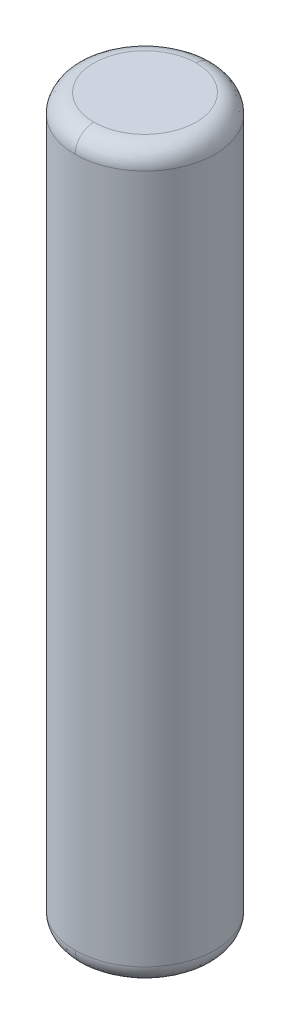
ISO-10303-21;
HEADER;
FILE_DESCRIPTION(('STEP AP214'),'2;1');
FILE_NAME('part.step','',(''),(''),'','','');
FILE_SCHEMA(('AUTOMOTIVE_DESIGN { 1 0 10303 214 1 1 1 1 }'));
ENDSEC;
DATA;
#1=APPLICATION_CONTEXT('core data for automotive mechanical design processes');
#2=APPLICATION_PROTOCOL_DEFINITION('international standard','automotive_design',2000,#1);
#3=PRODUCT_CONTEXT('',#1,'mechanical');
#4=PRODUCT('Part','Part','',(#3));
#5=PRODUCT_RELATED_PRODUCT_CATEGORY('part','',(#4));
#6=PRODUCT_DEFINITION_FORMATION('','',#4);
#7=PRODUCT_DEFINITION_CONTEXT('part definition',#1,'design');
#8=PRODUCT_DEFINITION('design','',#6,#7);
#9=PRODUCT_DEFINITION_SHAPE('','',#8);
#10=(LENGTH_UNIT() NAMED_UNIT(*) SI_UNIT(.MILLI.,.METRE.));
#11=(NAMED_UNIT(*) PLANE_ANGLE_UNIT() SI_UNIT($,.RADIAN.));
#12=(NAMED_UNIT(*) SI_UNIT($,.STERADIAN.) SOLID_ANGLE_UNIT());
#13=UNCERTAINTY_MEASURE_WITH_UNIT(LENGTH_MEASURE(1.E-05),#10,'distance_accuracy_value','');
#14=(GEOMETRIC_REPRESENTATION_CONTEXT(3) GLOBAL_UNCERTAINTY_ASSIGNED_CONTEXT((#13)) GLOBAL_UNIT_ASSIGNED_CONTEXT((#10,
#11,#12)) REPRESENTATION_CONTEXT('',''));
#15=CARTESIAN_POINT('',(0.,0.,0.));
#16=DIRECTION('',(0.,0.,1.));
#17=DIRECTION('',(1.,0.,0.));
#18=AXIS2_PLACEMENT_3D('',#15,#16,#17);
#19=CARTESIAN_POINT('',(-0.5566000044,3.8999999978,0.5566000044));
#20=DIRECTION('',(0.,-1.,0.));
#21=DIRECTION('',(0.,0.,-1.));
#22=AXIS2_PLACEMENT_3D('',#19,#20,#21);
#23=PLANE('',#22);
#24=CARTESIAN_POINT('',(0.,3.90000000531877,0.549999991873252));
#25=CARTESIAN_POINT('',(-1.10000000535587,3.90000000531877,0.549999991873253));
#26=CARTESIAN_POINT('',(-1.10000000535587,3.90000000531877,-0.549999991873253));
#27=CARTESIAN_POINT('',(0.,3.90000000531877,-0.549999991873252));
#28=(BOUNDED_CURVE() B_SPLINE_CURVE(3,(#24,#25,#26,#27),.UNSPECIFIED.,.F.,
.F.) B_SPLINE_CURVE_WITH_KNOTS((4,4),(0.,1.),
.UNSPECIFIED.) CURVE() GEOMETRIC_REPRESENTATION_ITEM() RATIONAL_B_SPLINE_CURVE((0.956578302165917,
0.318859434055306,0.318859434055306,0.956578302165917)) REPRESENTATION_ITEM(''));
#29=CARTESIAN_POINT('',(0.,3.90000000231126,0.549999996753954));
#30=VERTEX_POINT('',#29);
#31=CARTESIAN_POINT('',(0.,3.90000000231126,-0.549999996753954));
#32=VERTEX_POINT('',#31);
#33=EDGE_CURVE('E55',#30,#32,#28,.T.);
#34=ORIENTED_EDGE('',*,*,#33,.F.);
#35=CARTESIAN_POINT('',(0.,3.90000000531877,-0.549999991873252));
#36=CARTESIAN_POINT('',(1.10000000535587,3.90000000531877,-0.549999991873253));
#37=CARTESIAN_POINT('',(1.10000000535587,3.90000000531877,0.549999991873253));
#38=CARTESIAN_POINT('',(0.,3.90000000531877,0.549999991873252));
#39=(BOUNDED_CURVE() B_SPLINE_CURVE(3,(#35,#36,#37,#38),.UNSPECIFIED.,.F.,
.F.) B_SPLINE_CURVE_WITH_KNOTS((4,4),(0.,1.),
.UNSPECIFIED.) CURVE() GEOMETRIC_REPRESENTATION_ITEM() RATIONAL_B_SPLINE_CURVE((0.956578302165917,
0.318859434055306,0.318859434055306,0.956578302165917)) REPRESENTATION_ITEM(''));
#40=EDGE_CURVE('E71',#32,#30,#39,.T.);
#41=ORIENTED_EDGE('',*,*,#40,.F.);
#42=EDGE_LOOP('',(#34,#41));
#43=FACE_BOUND('',#42,.T.);
#44=ADVANCED_FACE('F16',(#43),#23,.F.);
#45=CARTESIAN_POINT('',(0.,3.899000838,-0.5300333062));
#46=CARTESIAN_POINT('',(-1.0600666378,3.899000838,-0.5300333062));
#47=CARTESIAN_POINT('',(-1.0600666378,3.899000838,0.5300333062));
#48=CARTESIAN_POINT('',(0.,3.899000838,0.5300333062));
#49=CARTESIAN_POINT('',(0.,3.9126440924,-0.6660107584));
#50=CARTESIAN_POINT('',(-1.3320215168,3.9126440924,-0.6660107584));
#51=CARTESIAN_POINT('',(-1.3320215168,3.9126440924,0.6660107584));
#52=CARTESIAN_POINT('',(0.,3.9126440924,0.6660107584));
#53=CARTESIAN_POINT('',(0.,3.8160107576,-0.7626440932));
#54=CARTESIAN_POINT('',(-1.525288161,3.8160107576,-0.7626440932));
#55=CARTESIAN_POINT('',(-1.525288161,3.8160107576,0.7626440932));
#56=CARTESIAN_POINT('',(0.,3.8160107576,0.7626440932));
#57=CARTESIAN_POINT('',(0.,3.6800333054,-0.7490008388));
#58=CARTESIAN_POINT('',(-1.4980016776,3.6800333054,-0.7490008388));
#59=CARTESIAN_POINT('',(-1.4980016776,3.6800333054,0.7490008388));
#60=CARTESIAN_POINT('',(0.,3.6800333054,0.7490008388));
#61=(BOUNDED_SURFACE() B_SPLINE_SURFACE(3,3,((#45,#46,#47,#48),(#49,#50,#51,#52),(#53,#54,#55,
#56),(#57,#58,#59,#60)),.UNSPECIFIED.,.F.,.F.,.F.) B_SPLINE_SURFACE_WITH_KNOTS((4,4),(4,4),(0.,
1.),(0.,1.),.UNSPECIFIED.) GEOMETRIC_REPRESENTATION_ITEM() RATIONAL_B_SPLINE_SURFACE(((1.,
0.333333333333333,0.333333333333333,1.),(0.755320871117975,0.251773623705992,0.251773623705992,
0.755320871117975),(0.755320871117975,0.251773623705992,0.251773623705992,0.755320871117975),
(1.,0.333333333333333,0.333333333333333,1.))) REPRESENTATION_ITEM('') SURFACE());
#62=CARTESIAN_POINT('',(0.,3.899000838,0.5300333062));
#63=CARTESIAN_POINT('',(0.,3.9126440924,0.6660107584));
#64=CARTESIAN_POINT('',(0.,3.8160107576,0.7626440932));
#65=CARTESIAN_POINT('',(0.,3.6800333054,0.7490008388));
#66=(BOUNDED_CURVE() B_SPLINE_CURVE(3,(#62,#63,#64,#65),.UNSPECIFIED.,.F.,
.F.) B_SPLINE_CURVE_WITH_KNOTS((4,4),(0.,1.),
.UNSPECIFIED.) CURVE() GEOMETRIC_REPRESENTATION_ITEM() RATIONAL_B_SPLINE_CURVE((1.,
0.755320871117975,0.755320871117975,1.)) REPRESENTATION_ITEM(''));
#67=CARTESIAN_POINT('',(-3.36726105979194E-11,3.69999999119576,0.75000000329923));
#68=VERTEX_POINT('',#67);
#69=EDGE_CURVE('E76',#30,#68,#66,.T.);
#70=CARTESIAN_POINT('',(0.,3.899000838,-0.5300333062));
#71=CARTESIAN_POINT('',(0.,3.9126440924,-0.6660107584));
#72=CARTESIAN_POINT('',(0.,3.8160107576,-0.7626440932));
#73=CARTESIAN_POINT('',(0.,3.6800333054,-0.7490008388));
#74=(BOUNDED_CURVE() B_SPLINE_CURVE(3,(#70,#71,#72,#73),.UNSPECIFIED.,.F.,
.F.) B_SPLINE_CURVE_WITH_KNOTS((4,4),(0.,1.),
.UNSPECIFIED.) CURVE() GEOMETRIC_REPRESENTATION_ITEM() RATIONAL_B_SPLINE_CURVE((1.,
0.755320871117975,0.755320871117975,1.)) REPRESENTATION_ITEM(''));
#75=CARTESIAN_POINT('',(0.,3.69999999115491,-0.750000006118768));
#76=VERTEX_POINT('',#75);
#77=EDGE_CURVE('E66',#76,#32,#74,.F.);
#78=CARTESIAN_POINT('',(0.,3.6999999914,0.));
#79=DIRECTION('',(0.,1.,0.));
#80=DIRECTION('',(0.,0.,1.));
#81=AXIS2_PLACEMENT_3D('',#78,#79,#80);
#82=CIRCLE('',#81,0.7499999986);
#83=EDGE_CURVE('E63',#76,#68,#82,.T.);
#84=ORIENTED_EDGE('',*,*,#69,.F.);
#85=ORIENTED_EDGE('',*,*,#33,.T.);
#86=ORIENTED_EDGE('',*,*,#77,.F.);
#87=ORIENTED_EDGE('',*,*,#83,.T.);
#88=EDGE_LOOP('',(#84,#85,#86,#87));
#89=FACE_BOUND('',#88,.T.);
#90=ADVANCED_FACE('F68',(#89),#61,.T.);
#91=CARTESIAN_POINT('',(0.,-3.6800333054,-0.7490008388));
#92=CARTESIAN_POINT('',(-1.4980016776,-3.6800333054,-0.7490008388));
#93=CARTESIAN_POINT('',(-1.4980016776,-3.6800333054,0.7490008388));
#94=CARTESIAN_POINT('',(0.,-3.6800333054,0.7490008388));
#95=CARTESIAN_POINT('',(0.,-3.8160107576,-0.7626440932));
#96=CARTESIAN_POINT('',(-1.525288161,-3.8160107576,-0.7626440932));
#97=CARTESIAN_POINT('',(-1.525288161,-3.8160107576,0.7626440932));
#98=CARTESIAN_POINT('',(0.,-3.8160107576,0.7626440932));
#99=CARTESIAN_POINT('',(0.,-3.9126440924,-0.6660107584));
#100=CARTESIAN_POINT('',(-1.3320215168,-3.9126440924,-0.6660107584));
#101=CARTESIAN_POINT('',(-1.3320215168,-3.9126440924,0.6660107584));
#102=CARTESIAN_POINT('',(0.,-3.9126440924,0.6660107584));
#103=CARTESIAN_POINT('',(0.,-3.899000838,-0.5300333062));
#104=CARTESIAN_POINT('',(-1.0600666378,-3.899000838,-0.5300333062));
#105=CARTESIAN_POINT('',(-1.0600666378,-3.899000838,0.5300333062));
#106=CARTESIAN_POINT('',(0.,-3.899000838,0.5300333062));
#107=(BOUNDED_SURFACE() B_SPLINE_SURFACE(3,3,((#91,#92,#93,#94),(#95,#96,#97,#98),(#99,#100,
#101,#102),(#103,#104,#105,#106)),.UNSPECIFIED.,.F.,.F.,.F.) B_SPLINE_SURFACE_WITH_KNOTS((4,4),
(4,4),(0.,1.),(0.,1.),
.UNSPECIFIED.) GEOMETRIC_REPRESENTATION_ITEM() RATIONAL_B_SPLINE_SURFACE(((1.,0.333333333333333,
0.333333333333333,1.),(0.755320871117975,0.251773623705992,0.251773623705992,0.755320871117975),
(0.755320871117975,0.251773623705992,0.251773623705992,0.755320871117975),(1.,0.333333333333333,
0.333333333333333,1.))) REPRESENTATION_ITEM('') SURFACE());
#108=CARTESIAN_POINT('',(0.,-3.6800333054,0.7490008388));
#109=CARTESIAN_POINT('',(0.,-3.8160107576,0.7626440932));
#110=CARTESIAN_POINT('',(0.,-3.9126440924,0.6660107584));
#111=CARTESIAN_POINT('',(0.,-3.899000838,0.5300333062));
#112=(BOUNDED_CURVE() B_SPLINE_CURVE(3,(#108,#109,#110,#111),.UNSPECIFIED.,.F.,
.F.) B_SPLINE_CURVE_WITH_KNOTS((4,4),(0.,1.),
.UNSPECIFIED.) CURVE() GEOMETRIC_REPRESENTATION_ITEM() RATIONAL_B_SPLINE_CURVE((1.,
0.755320871117975,0.755320871117975,1.)) REPRESENTATION_ITEM(''));
#113=CARTESIAN_POINT('',(0.,-3.90000000231126,0.549999999194317));
#114=VERTEX_POINT('',#113);
#115=CARTESIAN_POINT('',(0.,-3.69999999107321,0.750000006118768));
#116=VERTEX_POINT('',#115);
#117=EDGE_CURVE('E37',#114,#116,#112,.F.);
#118=CARTESIAN_POINT('',(0.,-3.6999999914,0.));
#119=DIRECTION('',(0.,1.,0.));
#120=DIRECTION('',(0.,0.,1.));
#121=AXIS2_PLACEMENT_3D('',#118,#119,#120);
#122=CIRCLE('',#121,0.7499999986);
#123=CARTESIAN_POINT('',(-1.34599124639647E-10,-3.69999999118555,-0.750000002359384));
#124=VERTEX_POINT('',#123);
#125=EDGE_CURVE('E82',#116,#124,#122,.F.);
#126=CARTESIAN_POINT('',(0.,-3.6800333054,-0.7490008388));
#127=CARTESIAN_POINT('',(0.,-3.8160107576,-0.7626440932));
#128=CARTESIAN_POINT('',(0.,-3.9126440924,-0.6660107584));
#129=CARTESIAN_POINT('',(0.,-3.899000838,-0.5300333062));
#130=(BOUNDED_CURVE() B_SPLINE_CURVE(3,(#126,#127,#128,#129),.UNSPECIFIED.,.F.,
.F.) B_SPLINE_CURVE_WITH_KNOTS((4,4),(0.,1.),
.UNSPECIFIED.) CURVE() GEOMETRIC_REPRESENTATION_ITEM() RATIONAL_B_SPLINE_CURVE((1.,
0.755320871117975,0.755320871117975,1.)) REPRESENTATION_ITEM(''));
#131=CARTESIAN_POINT('',(0.,-3.90000000231126,-0.549999999194317));
#132=VERTEX_POINT('',#131);
#133=EDGE_CURVE('E149',#124,#132,#130,.T.);
#134=CARTESIAN_POINT('',(0.,-3.90000000531877,-0.550000004075065));
#135=CARTESIAN_POINT('',(-1.10000002975949,-3.90000000531877,-0.550000004075065));
#136=CARTESIAN_POINT('',(-1.10000002975949,-3.90000000531877,0.550000004075065));
#137=CARTESIAN_POINT('',(0.,-3.90000000531877,0.550000004075065));
#138=(BOUNDED_CURVE() B_SPLINE_CURVE(3,(#134,#135,#136,#137),.UNSPECIFIED.,.F.,
.F.) B_SPLINE_CURVE_WITH_KNOTS((4,4),(0.,1.),
.UNSPECIFIED.) CURVE() GEOMETRIC_REPRESENTATION_ITEM() RATIONAL_B_SPLINE_CURVE((0.956578277992439,
0.31885942599748,0.31885942599748,0.956578277992439)) REPRESENTATION_ITEM(''));
#139=EDGE_CURVE('E78',#132,#114,#138,.T.);
#140=ORIENTED_EDGE('',*,*,#117,.T.);
#141=ORIENTED_EDGE('',*,*,#125,.T.);
#142=ORIENTED_EDGE('',*,*,#133,.T.);
#143=ORIENTED_EDGE('',*,*,#139,.T.);
#144=EDGE_LOOP('',(#140,#141,#142,#143));
#145=FACE_BOUND('',#144,.T.);
#146=ADVANCED_FACE('F109',(#145),#107,.T.);
#147=CARTESIAN_POINT('',(0.,3.899000838,0.5300333062));
#148=CARTESIAN_POINT('',(1.0600666378,3.899000838,0.5300333062));
#149=CARTESIAN_POINT('',(1.0600666378,3.899000838,-0.5300333062));
#150=CARTESIAN_POINT('',(0.,3.899000838,-0.5300333062));
#151=CARTESIAN_POINT('',(0.,3.9126440924,0.6660107584));
#152=CARTESIAN_POINT('',(1.3320215168,3.9126440924,0.6660107584));
#153=CARTESIAN_POINT('',(1.3320215168,3.9126440924,-0.6660107584));
#154=CARTESIAN_POINT('',(0.,3.9126440924,-0.6660107584));
#155=CARTESIAN_POINT('',(0.,3.8160107576,0.7626440932));
#156=CARTESIAN_POINT('',(1.525288161,3.8160107576,0.7626440932));
#157=CARTESIAN_POINT('',(1.525288161,3.8160107576,-0.7626440932));
#158=CARTESIAN_POINT('',(0.,3.8160107576,-0.7626440932));
#159=CARTESIAN_POINT('',(0.,3.6800333054,0.7490008388));
#160=CARTESIAN_POINT('',(1.4980016776,3.6800333054,0.7490008388));
#161=CARTESIAN_POINT('',(1.4980016776,3.6800333054,-0.7490008388));
#162=CARTESIAN_POINT('',(0.,3.6800333054,-0.7490008388));
#163=(BOUNDED_SURFACE() B_SPLINE_SURFACE(3,3,((#147,#148,#149,#150),(#151,#152,#153,#154),(#155,
#156,#157,#158),(#159,#160,#161,#162)),.UNSPECIFIED.,.F.,.F.,
.F.) B_SPLINE_SURFACE_WITH_KNOTS((4,4),(4,4),(0.,1.),(0.,1.),
.UNSPECIFIED.) GEOMETRIC_REPRESENTATION_ITEM() RATIONAL_B_SPLINE_SURFACE(((1.,0.333333333333333,
0.333333333333333,1.),(0.755320871117975,0.251773623705992,0.251773623705992,0.755320871117975),
(0.755320871117975,0.251773623705992,0.251773623705992,0.755320871117975),(1.,0.333333333333333,
0.333333333333333,1.))) REPRESENTATION_ITEM('') SURFACE());
#164=CARTESIAN_POINT('',(0.,3.6999999914,0.));
#165=DIRECTION('',(0.,1.,0.));
#166=DIRECTION('',(0.,0.,1.));
#167=AXIS2_PLACEMENT_3D('',#164,#165,#166);
#168=CIRCLE('',#167,0.7499999986);
#169=EDGE_CURVE('E74',#68,#76,#168,.T.);
#170=ORIENTED_EDGE('',*,*,#40,.T.);
#171=ORIENTED_EDGE('',*,*,#69,.T.);
#172=ORIENTED_EDGE('',*,*,#169,.T.);
#173=ORIENTED_EDGE('',*,*,#77,.T.);
#174=EDGE_LOOP('',(#170,#171,#172,#173));
#175=FACE_BOUND('',#174,.T.);
#176=ADVANCED_FACE('F75',(#175),#163,.T.);
#177=CARTESIAN_POINT('',(-0.5566000044,-3.8999999978,-0.5566000044));
#178=DIRECTION('',(0.,1.,0.));
#179=DIRECTION('',(0.,0.,1.));
#180=AXIS2_PLACEMENT_3D('',#177,#178,#179);
#181=PLANE('',#180);
#182=ORIENTED_EDGE('',*,*,#139,.F.);
#183=CARTESIAN_POINT('',(0.,-3.90000000531877,0.549999991873253));
#184=CARTESIAN_POINT('',(1.10000000535587,-3.90000000531877,0.549999991873252));
#185=CARTESIAN_POINT('',(1.10000000535587,-3.90000000531877,-0.549999991873252));
#186=CARTESIAN_POINT('',(0.,-3.90000000531877,-0.549999991873253));
#187=(BOUNDED_CURVE() B_SPLINE_CURVE(3,(#183,#184,#185,#186),.UNSPECIFIED.,.F.,
.F.) B_SPLINE_CURVE_WITH_KNOTS((4,4),(0.,1.),
.UNSPECIFIED.) CURVE() GEOMETRIC_REPRESENTATION_ITEM() RATIONAL_B_SPLINE_CURVE((0.956578302165917,
0.318859434055306,0.318859434055306,0.956578302165917)) REPRESENTATION_ITEM(''));
#188=EDGE_CURVE('E28',#114,#132,#187,.T.);
#189=ORIENTED_EDGE('',*,*,#188,.F.);
#190=EDGE_LOOP('',(#182,#189));
#191=FACE_BOUND('',#190,.T.);
#192=ADVANCED_FACE('F18',(#191),#181,.F.);
#193=CARTESIAN_POINT('',(0.,-3.6999999914,0.));
#194=DIRECTION('',(0.,1.,0.));
#195=DIRECTION('',(0.,0.,1.));
#196=AXIS2_PLACEMENT_3D('',#193,#194,#195);
#197=CYLINDRICAL_SURFACE('',#196,0.7499999986);
#198=ORIENTED_EDGE('',*,*,#169,.F.);
#199=ORIENTED_EDGE('',*,*,#83,.F.);
#200=EDGE_LOOP('',(#198,#199));
#201=FACE_BOUND('',#200,.T.);
#202=CARTESIAN_POINT('',(0.,-3.69999999107321,0.));
#203=DIRECTION('',(0.,-1.,0.));
#204=DIRECTION('',(1.,0.,0.));
#205=AXIS2_PLACEMENT_3D('',#202,#203,#204);
#206=CIRCLE('',#205,0.750000006118768);
#207=EDGE_CURVE('E11',#124,#116,#206,.T.);
#208=ORIENTED_EDGE('',*,*,#207,.F.);
#209=ORIENTED_EDGE('',*,*,#125,.F.);
#210=EDGE_LOOP('',(#208,#209));
#211=FACE_BOUND('',#210,.T.);
#212=ADVANCED_FACE('F80',(#201,#211),#197,.T.);
#213=CARTESIAN_POINT('',(0.,-3.6800333054,0.7490008388));
#214=CARTESIAN_POINT('',(1.4980016776,-3.6800333054,0.7490008388));
#215=CARTESIAN_POINT('',(1.4980016776,-3.6800333054,-0.7490008388));
#216=CARTESIAN_POINT('',(0.,-3.6800333054,-0.7490008388));
#217=CARTESIAN_POINT('',(0.,-3.8160107576,0.7626440932));
#218=CARTESIAN_POINT('',(1.525288161,-3.8160107576,0.7626440932));
#219=CARTESIAN_POINT('',(1.525288161,-3.8160107576,-0.7626440932));
#220=CARTESIAN_POINT('',(0.,-3.8160107576,-0.7626440932));
#221=CARTESIAN_POINT('',(0.,-3.9126440924,0.6660107584));
#222=CARTESIAN_POINT('',(1.3320215168,-3.9126440924,0.6660107584));
#223=CARTESIAN_POINT('',(1.3320215168,-3.9126440924,-0.6660107584));
#224=CARTESIAN_POINT('',(0.,-3.9126440924,-0.6660107584));
#225=CARTESIAN_POINT('',(0.,-3.899000838,0.5300333062));
#226=CARTESIAN_POINT('',(1.0600666378,-3.899000838,0.5300333062));
#227=CARTESIAN_POINT('',(1.0600666378,-3.899000838,-0.5300333062));
#228=CARTESIAN_POINT('',(0.,-3.899000838,-0.5300333062));
#229=(BOUNDED_SURFACE() B_SPLINE_SURFACE(3,3,((#213,#214,#215,#216),(#217,#218,#219,#220),(#221,
#222,#223,#224),(#225,#226,#227,#228)),.UNSPECIFIED.,.F.,.F.,
.F.) B_SPLINE_SURFACE_WITH_KNOTS((4,4),(4,4),(0.,1.),(0.,1.),
.UNSPECIFIED.) GEOMETRIC_REPRESENTATION_ITEM() RATIONAL_B_SPLINE_SURFACE(((1.,0.333333333333333,
0.333333333333333,1.),(0.755320871117975,0.251773623705992,0.251773623705992,0.755320871117975),
(0.755320871117975,0.251773623705992,0.251773623705992,0.755320871117975),(1.,0.333333333333333,
0.333333333333333,1.))) REPRESENTATION_ITEM('') SURFACE());
#230=ORIENTED_EDGE('',*,*,#207,.T.);
#231=ORIENTED_EDGE('',*,*,#117,.F.);
#232=ORIENTED_EDGE('',*,*,#188,.T.);
#233=ORIENTED_EDGE('',*,*,#133,.F.);
#234=EDGE_LOOP('',(#230,#231,#232,#233));
#235=FACE_BOUND('',#234,.T.);
#236=ADVANCED_FACE('F148',(#235),#229,.T.);
#237=CLOSED_SHELL('',(#44,#90,#146,#176,#192,#212,#236));
#238=MANIFOLD_SOLID_BREP('B1',#237);
#239=ADVANCED_BREP_SHAPE_REPRESENTATION('',(#18,#238),#14);
#240=SHAPE_DEFINITION_REPRESENTATION(#9,#239);
ENDSEC;
END-ISO-10303-21;
